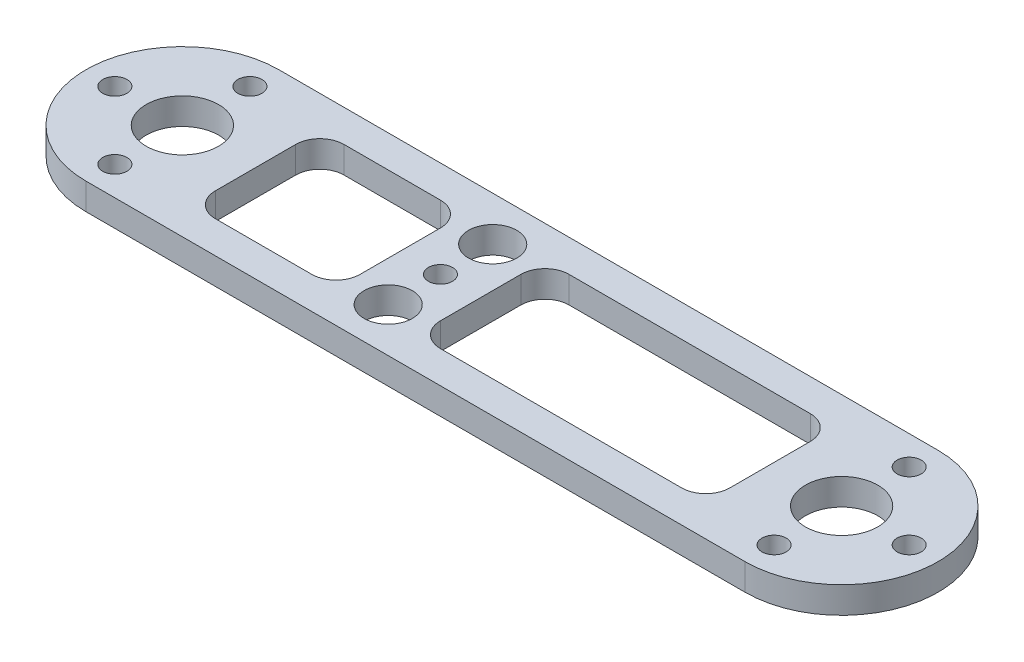
ISO-10303-21;
HEADER;
FILE_DESCRIPTION(('STEP AP214'),'2;1');
FILE_NAME('part.step','',(''),(''),'','','');
FILE_SCHEMA(('AUTOMOTIVE_DESIGN { 1 0 10303 214 1 1 1 1 }'));
ENDSEC;
DATA;
#1=APPLICATION_CONTEXT('core data for automotive mechanical design processes');
#2=APPLICATION_PROTOCOL_DEFINITION('international standard','automotive_design',2000,#1);
#3=PRODUCT_CONTEXT('',#1,'mechanical');
#4=PRODUCT('Part','Part','',(#3));
#5=PRODUCT_RELATED_PRODUCT_CATEGORY('part','',(#4));
#6=PRODUCT_DEFINITION_FORMATION('','',#4);
#7=PRODUCT_DEFINITION_CONTEXT('part definition',#1,'design');
#8=PRODUCT_DEFINITION('design','',#6,#7);
#9=PRODUCT_DEFINITION_SHAPE('','',#8);
#10=(LENGTH_UNIT() NAMED_UNIT(*) SI_UNIT(.MILLI.,.METRE.));
#11=(NAMED_UNIT(*) PLANE_ANGLE_UNIT() SI_UNIT($,.RADIAN.));
#12=(NAMED_UNIT(*) SI_UNIT($,.STERADIAN.) SOLID_ANGLE_UNIT());
#13=UNCERTAINTY_MEASURE_WITH_UNIT(LENGTH_MEASURE(1.E-05),#10,'distance_accuracy_value','');
#14=(GEOMETRIC_REPRESENTATION_CONTEXT(3) GLOBAL_UNCERTAINTY_ASSIGNED_CONTEXT((#13)) GLOBAL_UNIT_ASSIGNED_CONTEXT((#10,
#11,#12)) REPRESENTATION_CONTEXT('',''));
#15=CARTESIAN_POINT('',(0.,0.,0.));
#16=DIRECTION('',(0.,0.,1.));
#17=DIRECTION('',(1.,0.,0.));
#18=AXIS2_PLACEMENT_3D('',#15,#16,#17);
#19=CARTESIAN_POINT('',(-41.,3.3,0.));
#20=DIRECTION('',(0.,1.,0.));
#21=DIRECTION('',(0.,0.,1.));
#22=AXIS2_PLACEMENT_3D('',#19,#20,#21);
#23=PLANE('',#22);
#24=CARTESIAN_POINT('',(-8.89999999999998,3.3,-6.50000000000003));
#25=DIRECTION('',(0.,1.,0.));
#26=DIRECTION('',(0.,0.,1.));
#27=AXIS2_PLACEMENT_3D('',#24,#25,#26);
#28=CIRCLE('',#27,3.);
#29=CARTESIAN_POINT('',(-8.89999999999998,3.3,-3.50000000000003));
#30=VERTEX_POINT('',#29);
#31=EDGE_CURVE('E444',#30,#30,#28,.T.);
#32=ORIENTED_EDGE('',*,*,#31,.F.);
#33=EDGE_LOOP('',(#32));
#34=FACE_BOUND('',#33,.T.);
#35=DIRECTION('',(1.,0.,0.));
#36=VECTOR('',#35,1.);
#37=CARTESIAN_POINT('',(-28.9,3.3,8.));
#38=LINE('',#37,#36);
#39=CARTESIAN_POINT('',(-28.9,3.3,8.));
#40=VERTEX_POINT('',#39);
#41=CARTESIAN_POINT('',(-16.9,3.3,8.00000000000001));
#42=VERTEX_POINT('',#41);
#43=EDGE_CURVE('E177',#40,#42,#38,.T.);
#44=ORIENTED_EDGE('',*,*,#43,.F.);
#45=CARTESIAN_POINT('',(-28.9,3.3,5.));
#46=DIRECTION('',(0.,1.,0.));
#47=DIRECTION('',(0.,0.,1.));
#48=AXIS2_PLACEMENT_3D('',#45,#46,#47);
#49=CIRCLE('',#48,3.);
#50=CARTESIAN_POINT('',(-31.9,3.3,5.));
#51=VERTEX_POINT('',#50);
#52=EDGE_CURVE('E169',#51,#40,#49,.T.);
#53=ORIENTED_EDGE('',*,*,#52,.F.);
#54=DIRECTION('',(0.,0.,1.));
#55=VECTOR('',#54,1.);
#56=CARTESIAN_POINT('',(-31.9,3.3,-5.));
#57=LINE('',#56,#55);
#58=CARTESIAN_POINT('',(-31.9,3.3,-5.));
#59=VERTEX_POINT('',#58);
#60=EDGE_CURVE('E204',#59,#51,#57,.T.);
#61=ORIENTED_EDGE('',*,*,#60,.F.);
#62=CARTESIAN_POINT('',(-28.9,3.3,-5.));
#63=DIRECTION('',(0.,1.,0.));
#64=DIRECTION('',(0.,0.,1.));
#65=AXIS2_PLACEMENT_3D('',#62,#63,#64);
#66=CIRCLE('',#65,3.);
#67=CARTESIAN_POINT('',(-28.9,3.3,-8.));
#68=VERTEX_POINT('',#67);
#69=EDGE_CURVE('E202',#68,#59,#66,.T.);
#70=ORIENTED_EDGE('',*,*,#69,.F.);
#71=DIRECTION('',(-1.,0.,0.));
#72=VECTOR('',#71,1.);
#73=CARTESIAN_POINT('',(-28.9,3.3,-8.));
#74=LINE('',#73,#72);
#75=CARTESIAN_POINT('',(-16.9,3.3,-8.));
#76=VERTEX_POINT('',#75);
#77=EDGE_CURVE('E200',#76,#68,#74,.T.);
#78=ORIENTED_EDGE('',*,*,#77,.F.);
#79=CARTESIAN_POINT('',(-16.9,3.3,-5.));
#80=DIRECTION('',(0.,1.,0.));
#81=DIRECTION('',(0.,0.,-1.));
#82=AXIS2_PLACEMENT_3D('',#79,#80,#81);
#83=CIRCLE('',#82,3.);
#84=CARTESIAN_POINT('',(-13.9,3.3,-5.));
#85=VERTEX_POINT('',#84);
#86=EDGE_CURVE('E198',#85,#76,#83,.T.);
#87=ORIENTED_EDGE('',*,*,#86,.F.);
#88=DIRECTION('',(0.,0.,-1.));
#89=VECTOR('',#88,1.);
#90=CARTESIAN_POINT('',(-13.9,3.3,-5.));
#91=LINE('',#90,#89);
#92=CARTESIAN_POINT('',(-13.9,3.3,5.));
#93=VERTEX_POINT('',#92);
#94=EDGE_CURVE('E193',#93,#85,#91,.T.);
#95=ORIENTED_EDGE('',*,*,#94,.F.);
#96=CARTESIAN_POINT('',(-16.9,3.3,5.));
#97=DIRECTION('',(0.,1.,0.));
#98=DIRECTION('',(0.,0.,1.));
#99=AXIS2_PLACEMENT_3D('',#96,#97,#98);
#100=CIRCLE('',#99,3.);
#101=EDGE_CURVE('E191',#42,#93,#100,.T.);
#102=ORIENTED_EDGE('',*,*,#101,.F.);
#103=EDGE_LOOP('',(#44,#53,#61,#70,#78,#87,#95,#102));
#104=FACE_BOUND('',#103,.T.);
#105=CARTESIAN_POINT('',(-41.,3.3,0.));
#106=DIRECTION('',(0.,1.,0.));
#107=DIRECTION('',(0.,0.,-1.));
#108=AXIS2_PLACEMENT_3D('',#105,#106,#107);
#109=CIRCLE('',#108,4.5);
#110=CARTESIAN_POINT('',(-41.,3.3,-4.5));
#111=VERTEX_POINT('',#110);
#112=EDGE_CURVE('E296',#111,#111,#109,.T.);
#113=ORIENTED_EDGE('',*,*,#112,.F.);
#114=EDGE_LOOP('',(#113));
#115=FACE_BOUND('',#114,.T.);
#116=CARTESIAN_POINT('',(-49.4,3.3,0.));
#117=DIRECTION('',(0.,1.,0.));
#118=DIRECTION('',(0.,0.,-1.));
#119=AXIS2_PLACEMENT_3D('',#116,#117,#118);
#120=CIRCLE('',#119,1.5);
#121=CARTESIAN_POINT('',(-49.4,3.3,-1.5));
#122=VERTEX_POINT('',#121);
#123=EDGE_CURVE('E308',#122,#122,#120,.T.);
#124=ORIENTED_EDGE('',*,*,#123,.F.);
#125=EDGE_LOOP('',(#124));
#126=FACE_BOUND('',#125,.T.);
#127=CARTESIAN_POINT('',(49.4,3.3,0.));
#128=DIRECTION('',(0.,1.,0.));
#129=DIRECTION('',(0.,0.,1.));
#130=AXIS2_PLACEMENT_3D('',#127,#128,#129);
#131=CIRCLE('',#130,1.5);
#132=CARTESIAN_POINT('',(49.4,3.3,1.5));
#133=VERTEX_POINT('',#132);
#134=EDGE_CURVE('E320',#133,#133,#131,.T.);
#135=ORIENTED_EDGE('',*,*,#134,.F.);
#136=EDGE_LOOP('',(#135));
#137=FACE_BOUND('',#136,.T.);
#138=CARTESIAN_POINT('',(41.,3.3,0.));
#139=DIRECTION('',(0.,1.,0.));
#140=DIRECTION('',(0.,0.,1.));
#141=AXIS2_PLACEMENT_3D('',#138,#139,#140);
#142=CIRCLE('',#141,4.49999999999999);
#143=CARTESIAN_POINT('',(41.,3.3,4.49999999999999));
#144=VERTEX_POINT('',#143);
#145=EDGE_CURVE('E332',#144,#144,#142,.T.);
#146=ORIENTED_EDGE('',*,*,#145,.F.);
#147=EDGE_LOOP('',(#146));
#148=FACE_BOUND('',#147,.T.);
#149=CARTESIAN_POINT('',(-41.,3.3,0.));
#150=DIRECTION('',(0.,1.,0.));
#151=DIRECTION('',(0.,0.,1.));
#152=AXIS2_PLACEMENT_3D('',#149,#150,#151);
#153=CIRCLE('',#152,12.);
#154=CARTESIAN_POINT('',(-41.,3.3,-12.));
#155=VERTEX_POINT('',#154);
#156=CARTESIAN_POINT('',(-41.,3.3,12.));
#157=VERTEX_POINT('',#156);
#158=EDGE_CURVE('E344',#155,#157,#153,.T.);
#159=ORIENTED_EDGE('',*,*,#158,.T.);
#160=DIRECTION('',(1.,0.,0.));
#161=VECTOR('',#160,1.);
#162=CARTESIAN_POINT('',(41.,3.3,12.));
#163=LINE('',#162,#161);
#164=CARTESIAN_POINT('',(41.,3.3,12.));
#165=VERTEX_POINT('',#164);
#166=EDGE_CURVE('E347',#157,#165,#163,.T.);
#167=ORIENTED_EDGE('',*,*,#166,.T.);
#168=CARTESIAN_POINT('',(41.,3.3,0.));
#169=DIRECTION('',(0.,1.,0.));
#170=DIRECTION('',(0.,0.,-1.));
#171=AXIS2_PLACEMENT_3D('',#168,#169,#170);
#172=CIRCLE('',#171,12.);
#173=CARTESIAN_POINT('',(41.,3.3,-12.));
#174=VERTEX_POINT('',#173);
#175=EDGE_CURVE('E350',#165,#174,#172,.T.);
#176=ORIENTED_EDGE('',*,*,#175,.T.);
#177=DIRECTION('',(-1.,0.,0.));
#178=VECTOR('',#177,1.);
#179=CARTESIAN_POINT('',(41.,3.3,-12.));
#180=LINE('',#179,#178);
#181=EDGE_CURVE('E352',#174,#155,#180,.T.);
#182=ORIENTED_EDGE('',*,*,#181,.T.);
#183=EDGE_LOOP('',(#159,#167,#176,#182));
#184=FACE_BOUND('',#183,.T.);
#185=CARTESIAN_POINT('',(-41.,3.3,8.4));
#186=DIRECTION('',(0.,1.,0.));
#187=DIRECTION('',(0.,0.,-1.));
#188=AXIS2_PLACEMENT_3D('',#185,#186,#187);
#189=CIRCLE('',#188,1.5);
#190=CARTESIAN_POINT('',(-41.,3.3,6.9));
#191=VERTEX_POINT('',#190);
#192=EDGE_CURVE('E338',#191,#191,#189,.T.);
#193=ORIENTED_EDGE('',*,*,#192,.F.);
#194=EDGE_LOOP('',(#193));
#195=FACE_BOUND('',#194,.T.);
#196=CARTESIAN_POINT('',(41.,3.3,-8.4));
#197=DIRECTION('',(0.,1.,0.));
#198=DIRECTION('',(0.,0.,1.));
#199=AXIS2_PLACEMENT_3D('',#196,#197,#198);
#200=CIRCLE('',#199,1.5);
#201=CARTESIAN_POINT('',(41.,3.3,-6.9));
#202=VERTEX_POINT('',#201);
#203=EDGE_CURVE('E326',#202,#202,#200,.T.);
#204=ORIENTED_EDGE('',*,*,#203,.F.);
#205=EDGE_LOOP('',(#204));
#206=FACE_BOUND('',#205,.T.);
#207=CARTESIAN_POINT('',(41.,3.3,8.4));
#208=DIRECTION('',(0.,1.,0.));
#209=DIRECTION('',(0.,0.,1.));
#210=AXIS2_PLACEMENT_3D('',#207,#208,#209);
#211=CIRCLE('',#210,1.5);
#212=CARTESIAN_POINT('',(41.,3.3,9.90000000000001));
#213=VERTEX_POINT('',#212);
#214=EDGE_CURVE('E314',#213,#213,#211,.T.);
#215=ORIENTED_EDGE('',*,*,#214,.F.);
#216=EDGE_LOOP('',(#215));
#217=FACE_BOUND('',#216,.T.);
#218=CARTESIAN_POINT('',(-41.,3.3,-8.4));
#219=DIRECTION('',(0.,1.,0.));
#220=DIRECTION('',(0.,0.,-1.));
#221=AXIS2_PLACEMENT_3D('',#218,#219,#220);
#222=CIRCLE('',#221,1.5);
#223=CARTESIAN_POINT('',(-41.,3.3,-9.9));
#224=VERTEX_POINT('',#223);
#225=EDGE_CURVE('E302',#224,#224,#222,.T.);
#226=ORIENTED_EDGE('',*,*,#225,.F.);
#227=EDGE_LOOP('',(#226));
#228=FACE_BOUND('',#227,.T.);
#229=DIRECTION('',(-1.,0.,0.));
#230=VECTOR('',#229,1.);
#231=CARTESIAN_POINT('',(-0.899999999999977,3.3,-8.));
#232=LINE('',#231,#230);
#233=CARTESIAN_POINT('',(29.1,3.3,-8.));
#234=VERTEX_POINT('',#233);
#235=CARTESIAN_POINT('',(-0.899999999999977,3.3,-8.));
#236=VERTEX_POINT('',#235);
#237=EDGE_CURVE('E239',#234,#236,#232,.T.);
#238=ORIENTED_EDGE('',*,*,#237,.F.);
#239=CARTESIAN_POINT('',(29.1,3.3,-5.));
#240=DIRECTION('',(0.,1.,0.));
#241=DIRECTION('',(0.,0.,-1.));
#242=AXIS2_PLACEMENT_3D('',#239,#240,#241);
#243=CIRCLE('',#242,3.);
#244=CARTESIAN_POINT('',(32.1,3.3,-5.));
#245=VERTEX_POINT('',#244);
#246=EDGE_CURVE('E237',#245,#234,#243,.T.);
#247=ORIENTED_EDGE('',*,*,#246,.F.);
#248=DIRECTION('',(0.,0.,-1.));
#249=VECTOR('',#248,1.);
#250=CARTESIAN_POINT('',(32.1,3.3,-5.));
#251=LINE('',#250,#249);
#252=CARTESIAN_POINT('',(32.1,3.3,5.));
#253=VERTEX_POINT('',#252);
#254=EDGE_CURVE('E253',#253,#245,#251,.T.);
#255=ORIENTED_EDGE('',*,*,#254,.F.);
#256=CARTESIAN_POINT('',(29.1,3.3,5.));
#257=DIRECTION('',(0.,1.,0.));
#258=DIRECTION('',(0.,0.,1.));
#259=AXIS2_PLACEMENT_3D('',#256,#257,#258);
#260=CIRCLE('',#259,3.);
#261=CARTESIAN_POINT('',(29.1,3.3,8.));
#262=VERTEX_POINT('',#261);
#263=EDGE_CURVE('E250',#262,#253,#260,.T.);
#264=ORIENTED_EDGE('',*,*,#263,.F.);
#265=DIRECTION('',(1.,0.,0.));
#266=VECTOR('',#265,1.);
#267=CARTESIAN_POINT('',(-0.899999999999975,3.3,8.));
#268=LINE('',#267,#266);
#269=CARTESIAN_POINT('',(-0.899999999999975,3.3,8.));
#270=VERTEX_POINT('',#269);
#271=EDGE_CURVE('E248',#270,#262,#268,.T.);
#272=ORIENTED_EDGE('',*,*,#271,.F.);
#273=CARTESIAN_POINT('',(-0.899999999999975,3.3,5.));
#274=DIRECTION('',(0.,1.,0.));
#275=DIRECTION('',(0.,0.,1.));
#276=AXIS2_PLACEMENT_3D('',#273,#274,#275);
#277=CIRCLE('',#276,3.);
#278=CARTESIAN_POINT('',(-3.89999999999998,3.3,5.));
#279=VERTEX_POINT('',#278);
#280=EDGE_CURVE('E246',#279,#270,#277,.T.);
#281=ORIENTED_EDGE('',*,*,#280,.F.);
#282=DIRECTION('',(0.,0.,1.));
#283=VECTOR('',#282,1.);
#284=CARTESIAN_POINT('',(-3.89999999999998,3.3,-5.));
#285=LINE('',#284,#283);
#286=CARTESIAN_POINT('',(-3.89999999999998,3.3,-5.));
#287=VERTEX_POINT('',#286);
#288=EDGE_CURVE('E244',#287,#279,#285,.T.);
#289=ORIENTED_EDGE('',*,*,#288,.F.);
#290=CARTESIAN_POINT('',(-0.899999999999977,3.3,-5.));
#291=DIRECTION('',(0.,1.,0.));
#292=DIRECTION('',(0.,0.,1.));
#293=AXIS2_PLACEMENT_3D('',#290,#291,#292);
#294=CIRCLE('',#293,3.);
#295=EDGE_CURVE('E242',#236,#287,#294,.T.);
#296=ORIENTED_EDGE('',*,*,#295,.F.);
#297=EDGE_LOOP('',(#238,#247,#255,#264,#272,#281,#289,#296));
#298=FACE_BOUND('',#297,.T.);
#299=CARTESIAN_POINT('',(-8.89999999999998,3.3,0.));
#300=DIRECTION('',(0.,1.,0.));
#301=DIRECTION('',(0.,0.,1.));
#302=AXIS2_PLACEMENT_3D('',#299,#300,#301);
#303=CIRCLE('',#302,1.5);
#304=CARTESIAN_POINT('',(-8.89999999999998,3.3,1.5));
#305=VERTEX_POINT('',#304);
#306=EDGE_CURVE('E207',#305,#305,#303,.T.);
#307=ORIENTED_EDGE('',*,*,#306,.F.);
#308=EDGE_LOOP('',(#307));
#309=FACE_BOUND('',#308,.T.);
#310=CARTESIAN_POINT('',(-8.89999999999998,3.3,6.50000000000003));
#311=DIRECTION('',(0.,1.,0.));
#312=DIRECTION('',(0.,0.,-1.));
#313=AXIS2_PLACEMENT_3D('',#310,#311,#312);
#314=CIRCLE('',#313,3.);
#315=CARTESIAN_POINT('',(-8.89999999999998,3.3,3.50000000000003));
#316=VERTEX_POINT('',#315);
#317=EDGE_CURVE('E438',#316,#316,#314,.T.);
#318=ORIENTED_EDGE('',*,*,#317,.F.);
#319=EDGE_LOOP('',(#318));
#320=FACE_BOUND('',#319,.T.);
#321=ADVANCED_FACE('F32',(#34,#104,#115,#126,#137,#148,#184,#195,#206,#217,#228,#298,#309,#320),
#23,.T.);
#322=CARTESIAN_POINT('',(-41.,0.,0.));
#323=DIRECTION('',(0.,1.,0.));
#324=DIRECTION('',(0.,0.,1.));
#325=AXIS2_PLACEMENT_3D('',#322,#323,#324);
#326=PLANE('',#325);
#327=CARTESIAN_POINT('',(-8.89999999999998,0.,-6.50000000000003));
#328=DIRECTION('',(0.,1.,0.));
#329=DIRECTION('',(0.,0.,1.));
#330=AXIS2_PLACEMENT_3D('',#327,#328,#329);
#331=CIRCLE('',#330,3.);
#332=CARTESIAN_POINT('',(-8.89999999999998,0.,-3.50000000000003));
#333=VERTEX_POINT('',#332);
#334=EDGE_CURVE('E441',#333,#333,#331,.T.);
#335=ORIENTED_EDGE('',*,*,#334,.T.);
#336=EDGE_LOOP('',(#335));
#337=FACE_BOUND('',#336,.T.);
#338=CARTESIAN_POINT('',(-28.9,0.,5.));
#339=DIRECTION('',(0.,1.,0.));
#340=DIRECTION('',(0.,0.,1.));
#341=AXIS2_PLACEMENT_3D('',#338,#339,#340);
#342=CIRCLE('',#341,3.);
#343=CARTESIAN_POINT('',(-31.9,0.,5.));
#344=VERTEX_POINT('',#343);
#345=CARTESIAN_POINT('',(-28.9,0.,8.));
#346=VERTEX_POINT('',#345);
#347=EDGE_CURVE('E55',#344,#346,#342,.T.);
#348=ORIENTED_EDGE('',*,*,#347,.T.);
#349=DIRECTION('',(1.,0.,0.));
#350=VECTOR('',#349,1.);
#351=CARTESIAN_POINT('',(-28.9,0.,8.));
#352=LINE('',#351,#350);
#353=CARTESIAN_POINT('',(-16.9,0.,8.00000000000001));
#354=VERTEX_POINT('',#353);
#355=EDGE_CURVE('E184',#346,#354,#352,.T.);
#356=ORIENTED_EDGE('',*,*,#355,.T.);
#357=CARTESIAN_POINT('',(-16.9,0.,5.));
#358=DIRECTION('',(0.,1.,0.));
#359=DIRECTION('',(0.,0.,1.));
#360=AXIS2_PLACEMENT_3D('',#357,#358,#359);
#361=CIRCLE('',#360,3.);
#362=CARTESIAN_POINT('',(-13.9,0.,5.));
#363=VERTEX_POINT('',#362);
#364=EDGE_CURVE('E209',#354,#363,#361,.T.);
#365=ORIENTED_EDGE('',*,*,#364,.T.);
#366=DIRECTION('',(0.,0.,-1.));
#367=VECTOR('',#366,1.);
#368=CARTESIAN_POINT('',(-13.9,0.,-5.));
#369=LINE('',#368,#367);
#370=CARTESIAN_POINT('',(-13.9,0.,-5.));
#371=VERTEX_POINT('',#370);
#372=EDGE_CURVE('E212',#363,#371,#369,.T.);
#373=ORIENTED_EDGE('',*,*,#372,.T.);
#374=CARTESIAN_POINT('',(-16.9,0.,-5.));
#375=DIRECTION('',(0.,1.,0.));
#376=DIRECTION('',(0.,0.,-1.));
#377=AXIS2_PLACEMENT_3D('',#374,#375,#376);
#378=CIRCLE('',#377,3.);
#379=CARTESIAN_POINT('',(-16.9,0.,-8.));
#380=VERTEX_POINT('',#379);
#381=EDGE_CURVE('E215',#371,#380,#378,.T.);
#382=ORIENTED_EDGE('',*,*,#381,.T.);
#383=DIRECTION('',(-1.,0.,0.));
#384=VECTOR('',#383,1.);
#385=CARTESIAN_POINT('',(-28.9,0.,-8.));
#386=LINE('',#385,#384);
#387=CARTESIAN_POINT('',(-28.9,0.,-8.));
#388=VERTEX_POINT('',#387);
#389=EDGE_CURVE('E218',#380,#388,#386,.T.);
#390=ORIENTED_EDGE('',*,*,#389,.T.);
#391=CARTESIAN_POINT('',(-28.9,0.,-5.));
#392=DIRECTION('',(0.,1.,0.));
#393=DIRECTION('',(0.,0.,1.));
#394=AXIS2_PLACEMENT_3D('',#391,#392,#393);
#395=CIRCLE('',#394,3.);
#396=CARTESIAN_POINT('',(-31.9,0.,-5.));
#397=VERTEX_POINT('',#396);
#398=EDGE_CURVE('E221',#388,#397,#395,.T.);
#399=ORIENTED_EDGE('',*,*,#398,.T.);
#400=DIRECTION('',(0.,0.,1.));
#401=VECTOR('',#400,1.);
#402=CARTESIAN_POINT('',(-31.9,0.,-5.));
#403=LINE('',#402,#401);
#404=EDGE_CURVE('E178',#397,#344,#403,.T.);
#405=ORIENTED_EDGE('',*,*,#404,.T.);
#406=EDGE_LOOP('',(#348,#356,#365,#373,#382,#390,#399,#405));
#407=FACE_BOUND('',#406,.T.);
#408=CARTESIAN_POINT('',(-41.,0.,0.));
#409=DIRECTION('',(0.,1.,0.));
#410=DIRECTION('',(0.,0.,-1.));
#411=AXIS2_PLACEMENT_3D('',#408,#409,#410);
#412=CIRCLE('',#411,4.5);
#413=CARTESIAN_POINT('',(-41.,0.,-4.5));
#414=VERTEX_POINT('',#413);
#415=EDGE_CURVE('E295',#414,#414,#412,.T.);
#416=ORIENTED_EDGE('',*,*,#415,.T.);
#417=EDGE_LOOP('',(#416));
#418=FACE_BOUND('',#417,.T.);
#419=CARTESIAN_POINT('',(-49.4,0.,0.));
#420=DIRECTION('',(0.,1.,0.));
#421=DIRECTION('',(0.,0.,-1.));
#422=AXIS2_PLACEMENT_3D('',#419,#420,#421);
#423=CIRCLE('',#422,1.5);
#424=CARTESIAN_POINT('',(-49.4,0.,-1.5));
#425=VERTEX_POINT('',#424);
#426=EDGE_CURVE('E305',#425,#425,#423,.T.);
#427=ORIENTED_EDGE('',*,*,#426,.T.);
#428=EDGE_LOOP('',(#427));
#429=FACE_BOUND('',#428,.T.);
#430=CARTESIAN_POINT('',(49.4,0.,0.));
#431=DIRECTION('',(0.,1.,0.));
#432=DIRECTION('',(0.,0.,1.));
#433=AXIS2_PLACEMENT_3D('',#430,#431,#432);
#434=CIRCLE('',#433,1.5);
#435=CARTESIAN_POINT('',(49.4,0.,1.5));
#436=VERTEX_POINT('',#435);
#437=EDGE_CURVE('E317',#436,#436,#434,.T.);
#438=ORIENTED_EDGE('',*,*,#437,.T.);
#439=EDGE_LOOP('',(#438));
#440=FACE_BOUND('',#439,.T.);
#441=CARTESIAN_POINT('',(41.,0.,0.));
#442=DIRECTION('',(0.,1.,0.));
#443=DIRECTION('',(0.,0.,1.));
#444=AXIS2_PLACEMENT_3D('',#441,#442,#443);
#445=CIRCLE('',#444,4.49999999999999);
#446=CARTESIAN_POINT('',(41.,0.,4.49999999999999));
#447=VERTEX_POINT('',#446);
#448=EDGE_CURVE('E329',#447,#447,#445,.T.);
#449=ORIENTED_EDGE('',*,*,#448,.T.);
#450=EDGE_LOOP('',(#449));
#451=FACE_BOUND('',#450,.T.);
#452=CARTESIAN_POINT('',(-41.,0.,0.));
#453=DIRECTION('',(0.,1.,0.));
#454=DIRECTION('',(0.,0.,1.));
#455=AXIS2_PLACEMENT_3D('',#452,#453,#454);
#456=CIRCLE('',#455,12.);
#457=CARTESIAN_POINT('',(-41.,0.,-12.));
#458=VERTEX_POINT('',#457);
#459=CARTESIAN_POINT('',(-41.,0.,12.));
#460=VERTEX_POINT('',#459);
#461=EDGE_CURVE('E341',#458,#460,#456,.T.);
#462=ORIENTED_EDGE('',*,*,#461,.F.);
#463=DIRECTION('',(-1.,0.,0.));
#464=VECTOR('',#463,1.);
#465=CARTESIAN_POINT('',(41.,0.,-12.));
#466=LINE('',#465,#464);
#467=CARTESIAN_POINT('',(41.,0.,-12.));
#468=VERTEX_POINT('',#467);
#469=EDGE_CURVE('E348',#468,#458,#466,.T.);
#470=ORIENTED_EDGE('',*,*,#469,.F.);
#471=CARTESIAN_POINT('',(41.,0.,0.));
#472=DIRECTION('',(0.,1.,0.));
#473=DIRECTION('',(0.,0.,-1.));
#474=AXIS2_PLACEMENT_3D('',#471,#472,#473);
#475=CIRCLE('',#474,12.);
#476=CARTESIAN_POINT('',(41.,0.,12.));
#477=VERTEX_POINT('',#476);
#478=EDGE_CURVE('E359',#477,#468,#475,.T.);
#479=ORIENTED_EDGE('',*,*,#478,.F.);
#480=DIRECTION('',(1.,0.,0.));
#481=VECTOR('',#480,1.);
#482=CARTESIAN_POINT('',(41.,0.,12.));
#483=LINE('',#482,#481);
#484=EDGE_CURVE('E357',#460,#477,#483,.T.);
#485=ORIENTED_EDGE('',*,*,#484,.F.);
#486=EDGE_LOOP('',(#462,#470,#479,#485));
#487=FACE_BOUND('',#486,.T.);
#488=CARTESIAN_POINT('',(-41.,0.,8.4));
#489=DIRECTION('',(0.,1.,0.));
#490=DIRECTION('',(0.,0.,-1.));
#491=AXIS2_PLACEMENT_3D('',#488,#489,#490);
#492=CIRCLE('',#491,1.5);
#493=CARTESIAN_POINT('',(-41.,0.,6.9));
#494=VERTEX_POINT('',#493);
#495=EDGE_CURVE('E335',#494,#494,#492,.T.);
#496=ORIENTED_EDGE('',*,*,#495,.T.);
#497=EDGE_LOOP('',(#496));
#498=FACE_BOUND('',#497,.T.);
#499=CARTESIAN_POINT('',(41.,0.,-8.4));
#500=DIRECTION('',(0.,1.,0.));
#501=DIRECTION('',(0.,0.,1.));
#502=AXIS2_PLACEMENT_3D('',#499,#500,#501);
#503=CIRCLE('',#502,1.5);
#504=CARTESIAN_POINT('',(41.,0.,-6.9));
#505=VERTEX_POINT('',#504);
#506=EDGE_CURVE('E323',#505,#505,#503,.T.);
#507=ORIENTED_EDGE('',*,*,#506,.T.);
#508=EDGE_LOOP('',(#507));
#509=FACE_BOUND('',#508,.T.);
#510=CARTESIAN_POINT('',(41.,0.,8.4));
#511=DIRECTION('',(0.,1.,0.));
#512=DIRECTION('',(0.,0.,1.));
#513=AXIS2_PLACEMENT_3D('',#510,#511,#512);
#514=CIRCLE('',#513,1.5);
#515=CARTESIAN_POINT('',(41.,0.,9.90000000000001));
#516=VERTEX_POINT('',#515);
#517=EDGE_CURVE('E311',#516,#516,#514,.T.);
#518=ORIENTED_EDGE('',*,*,#517,.T.);
#519=EDGE_LOOP('',(#518));
#520=FACE_BOUND('',#519,.T.);
#521=CARTESIAN_POINT('',(-41.,0.,-8.4));
#522=DIRECTION('',(0.,1.,0.));
#523=DIRECTION('',(0.,0.,-1.));
#524=AXIS2_PLACEMENT_3D('',#521,#522,#523);
#525=CIRCLE('',#524,1.5);
#526=CARTESIAN_POINT('',(-41.,0.,-9.9));
#527=VERTEX_POINT('',#526);
#528=EDGE_CURVE('E299',#527,#527,#525,.T.);
#529=ORIENTED_EDGE('',*,*,#528,.T.);
#530=EDGE_LOOP('',(#529));
#531=FACE_BOUND('',#530,.T.);
#532=CARTESIAN_POINT('',(29.1,0.,-5.));
#533=DIRECTION('',(0.,1.,0.));
#534=DIRECTION('',(0.,0.,-1.));
#535=AXIS2_PLACEMENT_3D('',#532,#533,#534);
#536=CIRCLE('',#535,3.);
#537=CARTESIAN_POINT('',(32.1,0.,-5.));
#538=VERTEX_POINT('',#537);
#539=CARTESIAN_POINT('',(29.1,0.,-8.));
#540=VERTEX_POINT('',#539);
#541=EDGE_CURVE('E185',#538,#540,#536,.T.);
#542=ORIENTED_EDGE('',*,*,#541,.T.);
#543=DIRECTION('',(-1.,0.,0.));
#544=VECTOR('',#543,1.);
#545=CARTESIAN_POINT('',(-0.899999999999977,0.,-8.));
#546=LINE('',#545,#544);
#547=CARTESIAN_POINT('',(-0.899999999999977,0.,-8.));
#548=VERTEX_POINT('',#547);
#549=EDGE_CURVE('E258',#540,#548,#546,.T.);
#550=ORIENTED_EDGE('',*,*,#549,.T.);
#551=CARTESIAN_POINT('',(-0.899999999999977,0.,-5.));
#552=DIRECTION('',(0.,1.,0.));
#553=DIRECTION('',(0.,0.,1.));
#554=AXIS2_PLACEMENT_3D('',#551,#552,#553);
#555=CIRCLE('',#554,3.);
#556=CARTESIAN_POINT('',(-3.89999999999998,0.,-5.));
#557=VERTEX_POINT('',#556);
#558=EDGE_CURVE('E261',#548,#557,#555,.T.);
#559=ORIENTED_EDGE('',*,*,#558,.T.);
#560=DIRECTION('',(0.,0.,1.));
#561=VECTOR('',#560,1.);
#562=CARTESIAN_POINT('',(-3.89999999999998,0.,-5.));
#563=LINE('',#562,#561);
#564=CARTESIAN_POINT('',(-3.89999999999998,0.,5.));
#565=VERTEX_POINT('',#564);
#566=EDGE_CURVE('E264',#557,#565,#563,.T.);
#567=ORIENTED_EDGE('',*,*,#566,.T.);
#568=CARTESIAN_POINT('',(-0.899999999999975,0.,5.));
#569=DIRECTION('',(0.,1.,0.));
#570=DIRECTION('',(0.,0.,1.));
#571=AXIS2_PLACEMENT_3D('',#568,#569,#570);
#572=CIRCLE('',#571,3.);
#573=CARTESIAN_POINT('',(-0.899999999999975,0.,8.));
#574=VERTEX_POINT('',#573);
#575=EDGE_CURVE('E267',#565,#574,#572,.T.);
#576=ORIENTED_EDGE('',*,*,#575,.T.);
#577=DIRECTION('',(1.,0.,0.));
#578=VECTOR('',#577,1.);
#579=CARTESIAN_POINT('',(-0.899999999999975,0.,8.));
#580=LINE('',#579,#578);
#581=CARTESIAN_POINT('',(29.1,0.,8.));
#582=VERTEX_POINT('',#581);
#583=EDGE_CURVE('E270',#574,#582,#580,.T.);
#584=ORIENTED_EDGE('',*,*,#583,.T.);
#585=CARTESIAN_POINT('',(29.1,0.,5.));
#586=DIRECTION('',(0.,1.,0.));
#587=DIRECTION('',(0.,0.,1.));
#588=AXIS2_PLACEMENT_3D('',#585,#586,#587);
#589=CIRCLE('',#588,3.);
#590=CARTESIAN_POINT('',(32.1,0.,5.));
#591=VERTEX_POINT('',#590);
#592=EDGE_CURVE('E273',#582,#591,#589,.T.);
#593=ORIENTED_EDGE('',*,*,#592,.T.);
#594=DIRECTION('',(0.,0.,-1.));
#595=VECTOR('',#594,1.);
#596=CARTESIAN_POINT('',(32.1,0.,-5.));
#597=LINE('',#596,#595);
#598=EDGE_CURVE('E240',#591,#538,#597,.T.);
#599=ORIENTED_EDGE('',*,*,#598,.T.);
#600=EDGE_LOOP('',(#542,#550,#559,#567,#576,#584,#593,#599));
#601=FACE_BOUND('',#600,.T.);
#602=CARTESIAN_POINT('',(-8.89999999999998,0.,0.));
#603=DIRECTION('',(0.,1.,0.));
#604=DIRECTION('',(0.,0.,1.));
#605=AXIS2_PLACEMENT_3D('',#602,#603,#604);
#606=CIRCLE('',#605,1.5);
#607=CARTESIAN_POINT('',(-8.89999999999998,0.,1.5));
#608=VERTEX_POINT('',#607);
#609=EDGE_CURVE('E433',#608,#608,#606,.T.);
#610=ORIENTED_EDGE('',*,*,#609,.T.);
#611=EDGE_LOOP('',(#610));
#612=FACE_BOUND('',#611,.T.);
#613=CARTESIAN_POINT('',(-8.89999999999998,0.,6.50000000000003));
#614=DIRECTION('',(0.,1.,0.));
#615=DIRECTION('',(0.,0.,-1.));
#616=AXIS2_PLACEMENT_3D('',#613,#614,#615);
#617=CIRCLE('',#616,3.);
#618=CARTESIAN_POINT('',(-8.89999999999998,0.,3.50000000000003));
#619=VERTEX_POINT('',#618);
#620=EDGE_CURVE('E436',#619,#619,#617,.T.);
#621=ORIENTED_EDGE('',*,*,#620,.T.);
#622=EDGE_LOOP('',(#621));
#623=FACE_BOUND('',#622,.T.);
#624=ADVANCED_FACE('F377',(#337,#407,#418,#429,#440,#451,#487,#498,#509,#520,#531,#601,#612,
#623),#326,.F.);
#625=CARTESIAN_POINT('',(-41.,3.3,0.));
#626=DIRECTION('',(0.,-1.,0.));
#627=DIRECTION('',(0.,0.,-1.));
#628=AXIS2_PLACEMENT_3D('',#625,#626,#627);
#629=CYLINDRICAL_SURFACE('',#628,12.);
#630=ORIENTED_EDGE('',*,*,#461,.T.);
#631=DIRECTION('',(0.,-1.,0.));
#632=VECTOR('',#631,1.);
#633=CARTESIAN_POINT('',(-41.,3.3,12.));
#634=LINE('',#633,#632);
#635=EDGE_CURVE('E11',#157,#460,#634,.T.);
#636=ORIENTED_EDGE('',*,*,#635,.F.);
#637=ORIENTED_EDGE('',*,*,#158,.F.);
#638=DIRECTION('',(0.,-1.,0.));
#639=VECTOR('',#638,1.);
#640=CARTESIAN_POINT('',(-41.,3.3,-12.));
#641=LINE('',#640,#639);
#642=EDGE_CURVE('E354',#155,#458,#641,.T.);
#643=ORIENTED_EDGE('',*,*,#642,.T.);
#644=EDGE_LOOP('',(#630,#636,#637,#643));
#645=FACE_BOUND('',#644,.T.);
#646=ADVANCED_FACE('F34',(#645),#629,.T.);
#647=CARTESIAN_POINT('',(41.,3.3,12.));
#648=DIRECTION('',(0.,0.,-1.));
#649=DIRECTION('',(-1.,0.,0.));
#650=AXIS2_PLACEMENT_3D('',#647,#648,#649);
#651=PLANE('',#650);
#652=ORIENTED_EDGE('',*,*,#484,.T.);
#653=DIRECTION('',(0.,-1.,0.));
#654=VECTOR('',#653,1.);
#655=CARTESIAN_POINT('',(41.,3.3,12.));
#656=LINE('',#655,#654);
#657=EDGE_CURVE('E40',#165,#477,#656,.T.);
#658=ORIENTED_EDGE('',*,*,#657,.F.);
#659=ORIENTED_EDGE('',*,*,#166,.F.);
#660=ORIENTED_EDGE('',*,*,#635,.T.);
#661=EDGE_LOOP('',(#652,#658,#659,#660));
#662=FACE_BOUND('',#661,.T.);
#663=ADVANCED_FACE('F388',(#662),#651,.F.);
#664=CARTESIAN_POINT('',(41.,3.3,0.));
#665=DIRECTION('',(0.,-1.,0.));
#666=DIRECTION('',(0.,0.,-1.));
#667=AXIS2_PLACEMENT_3D('',#664,#665,#666);
#668=CYLINDRICAL_SURFACE('',#667,12.);
#669=ORIENTED_EDGE('',*,*,#478,.T.);
#670=DIRECTION('',(0.,-1.,0.));
#671=VECTOR('',#670,1.);
#672=CARTESIAN_POINT('',(41.,3.3,-12.));
#673=LINE('',#672,#671);
#674=EDGE_CURVE('E364',#174,#468,#673,.T.);
#675=ORIENTED_EDGE('',*,*,#674,.F.);
#676=ORIENTED_EDGE('',*,*,#175,.F.);
#677=ORIENTED_EDGE('',*,*,#657,.T.);
#678=EDGE_LOOP('',(#669,#675,#676,#677));
#679=FACE_BOUND('',#678,.T.);
#680=ADVANCED_FACE('F371',(#679),#668,.T.);
#681=CARTESIAN_POINT('',(41.,3.3,-12.));
#682=DIRECTION('',(0.,0.,1.));
#683=DIRECTION('',(1.,0.,0.));
#684=AXIS2_PLACEMENT_3D('',#681,#682,#683);
#685=PLANE('',#684);
#686=ORIENTED_EDGE('',*,*,#469,.T.);
#687=ORIENTED_EDGE('',*,*,#642,.F.);
#688=ORIENTED_EDGE('',*,*,#181,.F.);
#689=ORIENTED_EDGE('',*,*,#674,.T.);
#690=EDGE_LOOP('',(#686,#687,#688,#689));
#691=FACE_BOUND('',#690,.T.);
#692=ADVANCED_FACE('F381',(#691),#685,.F.);
#693=CARTESIAN_POINT('',(-41.,3.3,8.4));
#694=DIRECTION('',(0.,-1.,0.));
#695=DIRECTION('',(0.,0.,-1.));
#696=AXIS2_PLACEMENT_3D('',#693,#694,#695);
#697=CYLINDRICAL_SURFACE('',#696,1.5);
#698=ORIENTED_EDGE('',*,*,#192,.T.);
#699=EDGE_LOOP('',(#698));
#700=FACE_BOUND('',#699,.T.);
#701=ORIENTED_EDGE('',*,*,#495,.F.);
#702=EDGE_LOOP('',(#701));
#703=FACE_BOUND('',#702,.T.);
#704=ADVANCED_FACE('F405',(#700,#703),#697,.F.);
#705=CARTESIAN_POINT('',(41.,3.3,0.));
#706=DIRECTION('',(0.,-1.,0.));
#707=DIRECTION('',(0.,0.,-1.));
#708=AXIS2_PLACEMENT_3D('',#705,#706,#707);
#709=CYLINDRICAL_SURFACE('',#708,4.49999999999999);
#710=ORIENTED_EDGE('',*,*,#145,.T.);
#711=EDGE_LOOP('',(#710));
#712=FACE_BOUND('',#711,.T.);
#713=ORIENTED_EDGE('',*,*,#448,.F.);
#714=EDGE_LOOP('',(#713));
#715=FACE_BOUND('',#714,.T.);
#716=ADVANCED_FACE('F412',(#712,#715),#709,.F.);
#717=CARTESIAN_POINT('',(41.,3.3,-8.4));
#718=DIRECTION('',(0.,-1.,0.));
#719=DIRECTION('',(0.,0.,-1.));
#720=AXIS2_PLACEMENT_3D('',#717,#718,#719);
#721=CYLINDRICAL_SURFACE('',#720,1.5);
#722=ORIENTED_EDGE('',*,*,#203,.T.);
#723=EDGE_LOOP('',(#722));
#724=FACE_BOUND('',#723,.T.);
#725=ORIENTED_EDGE('',*,*,#506,.F.);
#726=EDGE_LOOP('',(#725));
#727=FACE_BOUND('',#726,.T.);
#728=ADVANCED_FACE('F417',(#724,#727),#721,.F.);
#729=CARTESIAN_POINT('',(49.4,3.3,0.));
#730=DIRECTION('',(0.,-1.,0.));
#731=DIRECTION('',(0.,0.,-1.));
#732=AXIS2_PLACEMENT_3D('',#729,#730,#731);
#733=CYLINDRICAL_SURFACE('',#732,1.5);
#734=ORIENTED_EDGE('',*,*,#134,.T.);
#735=EDGE_LOOP('',(#734));
#736=FACE_BOUND('',#735,.T.);
#737=ORIENTED_EDGE('',*,*,#437,.F.);
#738=EDGE_LOOP('',(#737));
#739=FACE_BOUND('',#738,.T.);
#740=ADVANCED_FACE('F544',(#736,#739),#733,.F.);
#741=CARTESIAN_POINT('',(41.,3.3,8.4));
#742=DIRECTION('',(0.,-1.,0.));
#743=DIRECTION('',(0.,0.,-1.));
#744=AXIS2_PLACEMENT_3D('',#741,#742,#743);
#745=CYLINDRICAL_SURFACE('',#744,1.5);
#746=ORIENTED_EDGE('',*,*,#214,.T.);
#747=EDGE_LOOP('',(#746));
#748=FACE_BOUND('',#747,.T.);
#749=ORIENTED_EDGE('',*,*,#517,.F.);
#750=EDGE_LOOP('',(#749));
#751=FACE_BOUND('',#750,.T.);
#752=ADVANCED_FACE('F540',(#748,#751),#745,.F.);
#753=CARTESIAN_POINT('',(-49.4,3.3,0.));
#754=DIRECTION('',(0.,-1.,0.));
#755=DIRECTION('',(0.,0.,-1.));
#756=AXIS2_PLACEMENT_3D('',#753,#754,#755);
#757=CYLINDRICAL_SURFACE('',#756,1.5);
#758=ORIENTED_EDGE('',*,*,#123,.T.);
#759=EDGE_LOOP('',(#758));
#760=FACE_BOUND('',#759,.T.);
#761=ORIENTED_EDGE('',*,*,#426,.F.);
#762=EDGE_LOOP('',(#761));
#763=FACE_BOUND('',#762,.T.);
#764=ADVANCED_FACE('F536',(#760,#763),#757,.F.);
#765=CARTESIAN_POINT('',(-41.,3.3,-8.4));
#766=DIRECTION('',(0.,-1.,0.));
#767=DIRECTION('',(0.,0.,-1.));
#768=AXIS2_PLACEMENT_3D('',#765,#766,#767);
#769=CYLINDRICAL_SURFACE('',#768,1.5);
#770=ORIENTED_EDGE('',*,*,#225,.T.);
#771=EDGE_LOOP('',(#770));
#772=FACE_BOUND('',#771,.T.);
#773=ORIENTED_EDGE('',*,*,#528,.F.);
#774=EDGE_LOOP('',(#773));
#775=FACE_BOUND('',#774,.T.);
#776=ADVANCED_FACE('F532',(#772,#775),#769,.F.);
#777=CARTESIAN_POINT('',(-41.,3.3,0.));
#778=DIRECTION('',(0.,-1.,0.));
#779=DIRECTION('',(0.,0.,-1.));
#780=AXIS2_PLACEMENT_3D('',#777,#778,#779);
#781=CYLINDRICAL_SURFACE('',#780,4.5);
#782=ORIENTED_EDGE('',*,*,#112,.T.);
#783=EDGE_LOOP('',(#782));
#784=FACE_BOUND('',#783,.T.);
#785=ORIENTED_EDGE('',*,*,#415,.F.);
#786=EDGE_LOOP('',(#785));
#787=FACE_BOUND('',#786,.T.);
#788=ADVANCED_FACE('F528',(#784,#787),#781,.F.);
#789=CARTESIAN_POINT('',(29.1,3.3,-5.));
#790=DIRECTION('',(0.,-1.,0.));
#791=DIRECTION('',(0.,0.,-1.));
#792=AXIS2_PLACEMENT_3D('',#789,#790,#791);
#793=CYLINDRICAL_SURFACE('',#792,3.);
#794=ORIENTED_EDGE('',*,*,#541,.F.);
#795=DIRECTION('',(0.,-1.,0.));
#796=VECTOR('',#795,1.);
#797=CARTESIAN_POINT('',(32.1,3.3,-5.));
#798=LINE('',#797,#796);
#799=EDGE_CURVE('E255',#245,#538,#798,.T.);
#800=ORIENTED_EDGE('',*,*,#799,.F.);
#801=ORIENTED_EDGE('',*,*,#246,.T.);
#802=DIRECTION('',(0.,-1.,0.));
#803=VECTOR('',#802,1.);
#804=CARTESIAN_POINT('',(29.1,3.3,-8.));
#805=LINE('',#804,#803);
#806=EDGE_CURVE('E292',#234,#540,#805,.T.);
#807=ORIENTED_EDGE('',*,*,#806,.T.);
#808=EDGE_LOOP('',(#794,#800,#801,#807));
#809=FACE_BOUND('',#808,.T.);
#810=ADVANCED_FACE('F524',(#809),#793,.F.);
#811=CARTESIAN_POINT('',(-0.899999999999977,3.3,-8.));
#812=DIRECTION('',(0.,0.,1.));
#813=DIRECTION('',(1.,0.,0.));
#814=AXIS2_PLACEMENT_3D('',#811,#812,#813);
#815=PLANE('',#814);
#816=ORIENTED_EDGE('',*,*,#549,.F.);
#817=ORIENTED_EDGE('',*,*,#806,.F.);
#818=ORIENTED_EDGE('',*,*,#237,.T.);
#819=DIRECTION('',(0.,-1.,0.));
#820=VECTOR('',#819,1.);
#821=CARTESIAN_POINT('',(-0.899999999999977,3.3,-8.));
#822=LINE('',#821,#820);
#823=EDGE_CURVE('E290',#236,#548,#822,.T.);
#824=ORIENTED_EDGE('',*,*,#823,.T.);
#825=EDGE_LOOP('',(#816,#817,#818,#824));
#826=FACE_BOUND('',#825,.T.);
#827=ADVANCED_FACE('F520',(#826),#815,.T.);
#828=CARTESIAN_POINT('',(-0.899999999999977,3.3,-5.));
#829=DIRECTION('',(0.,-1.,0.));
#830=DIRECTION('',(0.,0.,-1.));
#831=AXIS2_PLACEMENT_3D('',#828,#829,#830);
#832=CYLINDRICAL_SURFACE('',#831,3.);
#833=ORIENTED_EDGE('',*,*,#558,.F.);
#834=ORIENTED_EDGE('',*,*,#823,.F.);
#835=ORIENTED_EDGE('',*,*,#295,.T.);
#836=DIRECTION('',(0.,-1.,0.));
#837=VECTOR('',#836,1.);
#838=CARTESIAN_POINT('',(-3.89999999999998,3.3,-5.));
#839=LINE('',#838,#837);
#840=EDGE_CURVE('E288',#287,#557,#839,.T.);
#841=ORIENTED_EDGE('',*,*,#840,.T.);
#842=EDGE_LOOP('',(#833,#834,#835,#841));
#843=FACE_BOUND('',#842,.T.);
#844=ADVANCED_FACE('F516',(#843),#832,.F.);
#845=CARTESIAN_POINT('',(-3.89999999999998,3.3,-5.));
#846=DIRECTION('',(1.,0.,0.));
#847=DIRECTION('',(0.,0.,-1.));
#848=AXIS2_PLACEMENT_3D('',#845,#846,#847);
#849=PLANE('',#848);
#850=ORIENTED_EDGE('',*,*,#566,.F.);
#851=ORIENTED_EDGE('',*,*,#840,.F.);
#852=ORIENTED_EDGE('',*,*,#288,.T.);
#853=DIRECTION('',(0.,-1.,0.));
#854=VECTOR('',#853,1.);
#855=CARTESIAN_POINT('',(-3.89999999999998,3.3,5.));
#856=LINE('',#855,#854);
#857=EDGE_CURVE('E286',#279,#565,#856,.T.);
#858=ORIENTED_EDGE('',*,*,#857,.T.);
#859=EDGE_LOOP('',(#850,#851,#852,#858));
#860=FACE_BOUND('',#859,.T.);
#861=ADVANCED_FACE('F512',(#860),#849,.T.);
#862=CARTESIAN_POINT('',(-0.899999999999975,3.3,5.));
#863=DIRECTION('',(0.,-1.,0.));
#864=DIRECTION('',(0.,0.,-1.));
#865=AXIS2_PLACEMENT_3D('',#862,#863,#864);
#866=CYLINDRICAL_SURFACE('',#865,3.);
#867=ORIENTED_EDGE('',*,*,#575,.F.);
#868=ORIENTED_EDGE('',*,*,#857,.F.);
#869=ORIENTED_EDGE('',*,*,#280,.T.);
#870=DIRECTION('',(0.,-1.,0.));
#871=VECTOR('',#870,1.);
#872=CARTESIAN_POINT('',(-0.899999999999975,3.3,8.));
#873=LINE('',#872,#871);
#874=EDGE_CURVE('E284',#270,#574,#873,.T.);
#875=ORIENTED_EDGE('',*,*,#874,.T.);
#876=EDGE_LOOP('',(#867,#868,#869,#875));
#877=FACE_BOUND('',#876,.T.);
#878=ADVANCED_FACE('F508',(#877),#866,.F.);
#879=CARTESIAN_POINT('',(-0.899999999999975,3.3,8.));
#880=DIRECTION('',(0.,0.,-1.));
#881=DIRECTION('',(-1.,0.,0.));
#882=AXIS2_PLACEMENT_3D('',#879,#880,#881);
#883=PLANE('',#882);
#884=ORIENTED_EDGE('',*,*,#583,.F.);
#885=ORIENTED_EDGE('',*,*,#874,.F.);
#886=ORIENTED_EDGE('',*,*,#271,.T.);
#887=DIRECTION('',(0.,-1.,0.));
#888=VECTOR('',#887,1.);
#889=CARTESIAN_POINT('',(29.1,3.3,8.));
#890=LINE('',#889,#888);
#891=EDGE_CURVE('E282',#262,#582,#890,.T.);
#892=ORIENTED_EDGE('',*,*,#891,.T.);
#893=EDGE_LOOP('',(#884,#885,#886,#892));
#894=FACE_BOUND('',#893,.T.);
#895=ADVANCED_FACE('F504',(#894),#883,.T.);
#896=CARTESIAN_POINT('',(29.1,3.3,5.));
#897=DIRECTION('',(0.,-1.,0.));
#898=DIRECTION('',(0.,0.,-1.));
#899=AXIS2_PLACEMENT_3D('',#896,#897,#898);
#900=CYLINDRICAL_SURFACE('',#899,3.);
#901=ORIENTED_EDGE('',*,*,#592,.F.);
#902=ORIENTED_EDGE('',*,*,#891,.F.);
#903=ORIENTED_EDGE('',*,*,#263,.T.);
#904=DIRECTION('',(0.,-1.,0.));
#905=VECTOR('',#904,1.);
#906=CARTESIAN_POINT('',(32.1,3.3,5.));
#907=LINE('',#906,#905);
#908=EDGE_CURVE('E280',#253,#591,#907,.T.);
#909=ORIENTED_EDGE('',*,*,#908,.T.);
#910=EDGE_LOOP('',(#901,#902,#903,#909));
#911=FACE_BOUND('',#910,.T.);
#912=ADVANCED_FACE('F500',(#911),#900,.F.);
#913=CARTESIAN_POINT('',(32.1,3.3,-5.));
#914=DIRECTION('',(-1.,0.,0.));
#915=DIRECTION('',(0.,0.,1.));
#916=AXIS2_PLACEMENT_3D('',#913,#914,#915);
#917=PLANE('',#916);
#918=ORIENTED_EDGE('',*,*,#598,.F.);
#919=ORIENTED_EDGE('',*,*,#908,.F.);
#920=ORIENTED_EDGE('',*,*,#254,.T.);
#921=ORIENTED_EDGE('',*,*,#799,.T.);
#922=EDGE_LOOP('',(#918,#919,#920,#921));
#923=FACE_BOUND('',#922,.T.);
#924=ADVANCED_FACE('F497',(#923),#917,.T.);
#925=CARTESIAN_POINT('',(-28.9,3.3,5.));
#926=DIRECTION('',(0.,-1.,0.));
#927=DIRECTION('',(0.,0.,-1.));
#928=AXIS2_PLACEMENT_3D('',#925,#926,#927);
#929=CYLINDRICAL_SURFACE('',#928,3.);
#930=ORIENTED_EDGE('',*,*,#347,.F.);
#931=DIRECTION('',(0.,-1.,0.));
#932=VECTOR('',#931,1.);
#933=CARTESIAN_POINT('',(-31.9,3.3,5.));
#934=LINE('',#933,#932);
#935=EDGE_CURVE('E173',#51,#344,#934,.T.);
#936=ORIENTED_EDGE('',*,*,#935,.F.);
#937=ORIENTED_EDGE('',*,*,#52,.T.);
#938=DIRECTION('',(0.,-1.,0.));
#939=VECTOR('',#938,1.);
#940=CARTESIAN_POINT('',(-28.9,3.3,8.));
#941=LINE('',#940,#939);
#942=EDGE_CURVE('E172',#40,#346,#941,.T.);
#943=ORIENTED_EDGE('',*,*,#942,.T.);
#944=EDGE_LOOP('',(#930,#936,#937,#943));
#945=FACE_BOUND('',#944,.T.);
#946=ADVANCED_FACE('F171',(#945),#929,.F.);
#947=CARTESIAN_POINT('',(-28.9,3.3,8.));
#948=DIRECTION('',(0.,0.,-1.));
#949=DIRECTION('',(-1.,0.,0.));
#950=AXIS2_PLACEMENT_3D('',#947,#948,#949);
#951=PLANE('',#950);
#952=ORIENTED_EDGE('',*,*,#355,.F.);
#953=ORIENTED_EDGE('',*,*,#942,.F.);
#954=ORIENTED_EDGE('',*,*,#43,.T.);
#955=DIRECTION('',(0.,-1.,0.));
#956=VECTOR('',#955,1.);
#957=CARTESIAN_POINT('',(-16.9,3.3,8.00000000000001));
#958=LINE('',#957,#956);
#959=EDGE_CURVE('E186',#42,#354,#958,.T.);
#960=ORIENTED_EDGE('',*,*,#959,.T.);
#961=EDGE_LOOP('',(#952,#953,#954,#960));
#962=FACE_BOUND('',#961,.T.);
#963=ADVANCED_FACE('F181',(#962),#951,.T.);
#964=CARTESIAN_POINT('',(-16.9,3.3,5.));
#965=DIRECTION('',(0.,-1.,0.));
#966=DIRECTION('',(0.,0.,-1.));
#967=AXIS2_PLACEMENT_3D('',#964,#965,#966);
#968=CYLINDRICAL_SURFACE('',#967,3.);
#969=ORIENTED_EDGE('',*,*,#364,.F.);
#970=ORIENTED_EDGE('',*,*,#959,.F.);
#971=ORIENTED_EDGE('',*,*,#101,.T.);
#972=DIRECTION('',(0.,-1.,0.));
#973=VECTOR('',#972,1.);
#974=CARTESIAN_POINT('',(-13.9,3.3,5.));
#975=LINE('',#974,#973);
#976=EDGE_CURVE('E234',#93,#363,#975,.T.);
#977=ORIENTED_EDGE('',*,*,#976,.T.);
#978=EDGE_LOOP('',(#969,#970,#971,#977));
#979=FACE_BOUND('',#978,.T.);
#980=ADVANCED_FACE('F488',(#979),#968,.F.);
#981=CARTESIAN_POINT('',(-13.9,3.3,-5.));
#982=DIRECTION('',(-1.,0.,0.));
#983=DIRECTION('',(0.,0.,1.));
#984=AXIS2_PLACEMENT_3D('',#981,#982,#983);
#985=PLANE('',#984);
#986=ORIENTED_EDGE('',*,*,#372,.F.);
#987=ORIENTED_EDGE('',*,*,#976,.F.);
#988=ORIENTED_EDGE('',*,*,#94,.T.);
#989=DIRECTION('',(0.,-1.,0.));
#990=VECTOR('',#989,1.);
#991=CARTESIAN_POINT('',(-13.9,3.3,-5.));
#992=LINE('',#991,#990);
#993=EDGE_CURVE('E232',#85,#371,#992,.T.);
#994=ORIENTED_EDGE('',*,*,#993,.T.);
#995=EDGE_LOOP('',(#986,#987,#988,#994));
#996=FACE_BOUND('',#995,.T.);
#997=ADVANCED_FACE('F484',(#996),#985,.T.);
#998=CARTESIAN_POINT('',(-16.9,3.3,-5.));
#999=DIRECTION('',(0.,-1.,0.));
#1000=DIRECTION('',(0.,0.,-1.));
#1001=AXIS2_PLACEMENT_3D('',#998,#999,#1000);
#1002=CYLINDRICAL_SURFACE('',#1001,3.);
#1003=ORIENTED_EDGE('',*,*,#381,.F.);
#1004=ORIENTED_EDGE('',*,*,#993,.F.);
#1005=ORIENTED_EDGE('',*,*,#86,.T.);
#1006=DIRECTION('',(0.,-1.,0.));
#1007=VECTOR('',#1006,1.);
#1008=CARTESIAN_POINT('',(-16.9,3.3,-8.));
#1009=LINE('',#1008,#1007);
#1010=EDGE_CURVE('E230',#76,#380,#1009,.T.);
#1011=ORIENTED_EDGE('',*,*,#1010,.T.);
#1012=EDGE_LOOP('',(#1003,#1004,#1005,#1011));
#1013=FACE_BOUND('',#1012,.T.);
#1014=ADVANCED_FACE('F480',(#1013),#1002,.F.);
#1015=CARTESIAN_POINT('',(-28.9,3.3,-8.));
#1016=DIRECTION('',(0.,0.,1.));
#1017=DIRECTION('',(1.,0.,0.));
#1018=AXIS2_PLACEMENT_3D('',#1015,#1016,#1017);
#1019=PLANE('',#1018);
#1020=ORIENTED_EDGE('',*,*,#389,.F.);
#1021=ORIENTED_EDGE('',*,*,#1010,.F.);
#1022=ORIENTED_EDGE('',*,*,#77,.T.);
#1023=DIRECTION('',(0.,-1.,0.));
#1024=VECTOR('',#1023,1.);
#1025=CARTESIAN_POINT('',(-28.9,3.3,-8.));
#1026=LINE('',#1025,#1024);
#1027=EDGE_CURVE('E228',#68,#388,#1026,.T.);
#1028=ORIENTED_EDGE('',*,*,#1027,.T.);
#1029=EDGE_LOOP('',(#1020,#1021,#1022,#1028));
#1030=FACE_BOUND('',#1029,.T.);
#1031=ADVANCED_FACE('F476',(#1030),#1019,.T.);
#1032=CARTESIAN_POINT('',(-28.9,3.3,-5.));
#1033=DIRECTION('',(0.,-1.,0.));
#1034=DIRECTION('',(0.,0.,-1.));
#1035=AXIS2_PLACEMENT_3D('',#1032,#1033,#1034);
#1036=CYLINDRICAL_SURFACE('',#1035,3.);
#1037=ORIENTED_EDGE('',*,*,#398,.F.);
#1038=ORIENTED_EDGE('',*,*,#1027,.F.);
#1039=ORIENTED_EDGE('',*,*,#69,.T.);
#1040=DIRECTION('',(0.,-1.,0.));
#1041=VECTOR('',#1040,1.);
#1042=CARTESIAN_POINT('',(-31.9,3.3,-5.));
#1043=LINE('',#1042,#1041);
#1044=EDGE_CURVE('E47',#59,#397,#1043,.T.);
#1045=ORIENTED_EDGE('',*,*,#1044,.T.);
#1046=EDGE_LOOP('',(#1037,#1038,#1039,#1045));
#1047=FACE_BOUND('',#1046,.T.);
#1048=ADVANCED_FACE('F473',(#1047),#1036,.F.);
#1049=CARTESIAN_POINT('',(-31.9,3.3,-5.));
#1050=DIRECTION('',(1.,0.,0.));
#1051=DIRECTION('',(0.,0.,-1.));
#1052=AXIS2_PLACEMENT_3D('',#1049,#1050,#1051);
#1053=PLANE('',#1052);
#1054=ORIENTED_EDGE('',*,*,#404,.F.);
#1055=ORIENTED_EDGE('',*,*,#1044,.F.);
#1056=ORIENTED_EDGE('',*,*,#60,.T.);
#1057=ORIENTED_EDGE('',*,*,#935,.T.);
#1058=EDGE_LOOP('',(#1054,#1055,#1056,#1057));
#1059=FACE_BOUND('',#1058,.T.);
#1060=ADVANCED_FACE('F470',(#1059),#1053,.T.);
#1061=CARTESIAN_POINT('',(-8.89999999999998,3.3,0.));
#1062=DIRECTION('',(0.,-1.,0.));
#1063=DIRECTION('',(0.,0.,-1.));
#1064=AXIS2_PLACEMENT_3D('',#1061,#1062,#1063);
#1065=CYLINDRICAL_SURFACE('',#1064,1.5);
#1066=ORIENTED_EDGE('',*,*,#306,.T.);
#1067=EDGE_LOOP('',(#1066));
#1068=FACE_BOUND('',#1067,.T.);
#1069=ORIENTED_EDGE('',*,*,#609,.F.);
#1070=EDGE_LOOP('',(#1069));
#1071=FACE_BOUND('',#1070,.T.);
#1072=ADVANCED_FACE('F452',(#1068,#1071),#1065,.F.);
#1073=CARTESIAN_POINT('',(-8.89999999999998,3.3,-6.50000000000003));
#1074=DIRECTION('',(0.,-1.,0.));
#1075=DIRECTION('',(0.,0.,-1.));
#1076=AXIS2_PLACEMENT_3D('',#1073,#1074,#1075);
#1077=CYLINDRICAL_SURFACE('',#1076,3.);
#1078=ORIENTED_EDGE('',*,*,#31,.T.);
#1079=EDGE_LOOP('',(#1078));
#1080=FACE_BOUND('',#1079,.T.);
#1081=ORIENTED_EDGE('',*,*,#334,.F.);
#1082=EDGE_LOOP('',(#1081));
#1083=FACE_BOUND('',#1082,.T.);
#1084=ADVANCED_FACE('F460',(#1080,#1083),#1077,.F.);
#1085=CARTESIAN_POINT('',(-8.89999999999998,3.3,6.50000000000003));
#1086=DIRECTION('',(0.,-1.,0.));
#1087=DIRECTION('',(0.,0.,-1.));
#1088=AXIS2_PLACEMENT_3D('',#1085,#1086,#1087);
#1089=CYLINDRICAL_SURFACE('',#1088,3.);
#1090=ORIENTED_EDGE('',*,*,#317,.T.);
#1091=EDGE_LOOP('',(#1090));
#1092=FACE_BOUND('',#1091,.T.);
#1093=ORIENTED_EDGE('',*,*,#620,.F.);
#1094=EDGE_LOOP('',(#1093));
#1095=FACE_BOUND('',#1094,.T.);
#1096=ADVANCED_FACE('F458',(#1092,#1095),#1089,.F.);
#1097=CLOSED_SHELL('',(#321,#624,#646,#663,#680,#692,#704,#716,#728,#740,#752,#764,#776,#788,
#810,#827,#844,#861,#878,#895,#912,#924,#946,#963,#980,#997,#1014,#1031,#1048,#1060,#1072,#1084,#1096));
#1098=MANIFOLD_SOLID_BREP('B2',#1097);
#1099=ADVANCED_BREP_SHAPE_REPRESENTATION('',(#18,#1098),#14);
#1100=SHAPE_DEFINITION_REPRESENTATION(#9,#1099);
ENDSEC;
END-ISO-10303-21;
